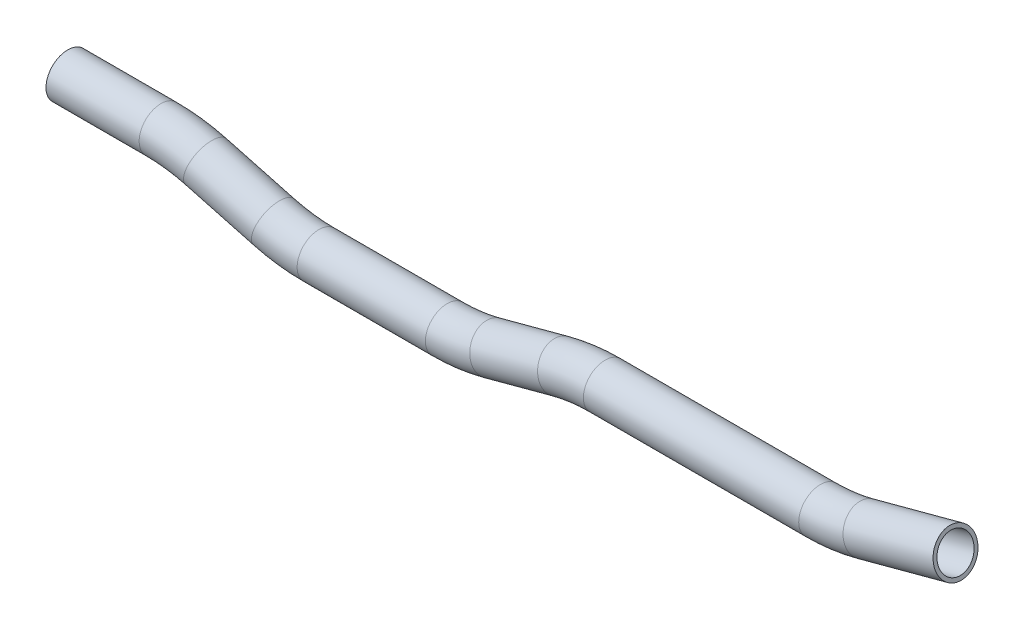
ISO-10303-21;
HEADER;
FILE_DESCRIPTION(('STEP AP214'),'2;1');
FILE_NAME('part.step','',(''),(''),'','','');
FILE_SCHEMA(('AUTOMOTIVE_DESIGN { 1 0 10303 214 1 1 1 1 }'));
ENDSEC;
DATA;
#1=APPLICATION_CONTEXT('core data for automotive mechanical design processes');
#2=APPLICATION_PROTOCOL_DEFINITION('international standard','automotive_design',2000,#1);
#3=PRODUCT_CONTEXT('',#1,'mechanical');
#4=PRODUCT('Part','Part','',(#3));
#5=PRODUCT_RELATED_PRODUCT_CATEGORY('part','',(#4));
#6=PRODUCT_DEFINITION_FORMATION('','',#4);
#7=PRODUCT_DEFINITION_CONTEXT('part definition',#1,'design');
#8=PRODUCT_DEFINITION('design','',#6,#7);
#9=PRODUCT_DEFINITION_SHAPE('','',#8);
#10=(LENGTH_UNIT() NAMED_UNIT(*) SI_UNIT(.MILLI.,.METRE.));
#11=(NAMED_UNIT(*) PLANE_ANGLE_UNIT() SI_UNIT($,.RADIAN.));
#12=(NAMED_UNIT(*) SI_UNIT($,.STERADIAN.) SOLID_ANGLE_UNIT());
#13=UNCERTAINTY_MEASURE_WITH_UNIT(LENGTH_MEASURE(1.E-05),#10,'distance_accuracy_value','');
#14=(GEOMETRIC_REPRESENTATION_CONTEXT(3) GLOBAL_UNCERTAINTY_ASSIGNED_CONTEXT((#13)) GLOBAL_UNIT_ASSIGNED_CONTEXT((#10,
#11,#12)) REPRESENTATION_CONTEXT('',''));
#15=CARTESIAN_POINT('',(0.,0.,0.));
#16=DIRECTION('',(0.,0.,1.));
#17=DIRECTION('',(1.,0.,0.));
#18=AXIS2_PLACEMENT_3D('',#15,#16,#17);
#19=CARTESIAN_POINT('',(27.5702699999885,26.4550342366762,0.));
#20=DIRECTION('',(1.,0.,0.));
#21=DIRECTION('',(0.,1.,0.));
#22=AXIS2_PLACEMENT_3D('',#19,#20,#21);
#23=CYLINDRICAL_SURFACE('',#22,9.525);
#24=CARTESIAN_POINT('',(68.338349683829,26.4550342366762,0.));
#25=DIRECTION('',(1.,0.,0.));
#26=DIRECTION('',(0.,1.,0.));
#27=AXIS2_PLACEMENT_3D('',#24,#25,#26);
#28=CIRCLE('',#27,9.525);
#29=CARTESIAN_POINT('',(68.338349683829,35.9800342366761,0.));
#30=VERTEX_POINT('',#29);
#31=EDGE_CURVE('E65',#30,#30,#28,.T.);
#32=ORIENTED_EDGE('',*,*,#31,.F.);
#33=EDGE_LOOP('',(#32));
#34=FACE_BOUND('',#33,.T.);
#35=CARTESIAN_POINT('',(27.5702699999885,26.4550342366762,0.));
#36=DIRECTION('',(1.,0.,0.));
#37=DIRECTION('',(0.,1.,0.));
#38=AXIS2_PLACEMENT_3D('',#35,#36,#37);
#39=CIRCLE('',#38,9.525);
#40=CARTESIAN_POINT('',(27.5702699999885,35.9800342366762,0.));
#41=VERTEX_POINT('',#40);
#42=EDGE_CURVE('E61',#41,#41,#39,.T.);
#43=ORIENTED_EDGE('',*,*,#42,.T.);
#44=EDGE_LOOP('',(#43));
#45=FACE_BOUND('',#44,.T.);
#46=ADVANCED_FACE('F37',(#34,#45),#23,.T.);
#47=CARTESIAN_POINT('',(68.338349683829,-49.7449657633238,0.));
#48=DIRECTION('',(0.,0.,-1.));
#49=DIRECTION('',(-1.,0.,0.));
#50=AXIS2_PLACEMENT_3D('',#47,#48,#49);
#51=TOROIDAL_SURFACE('',#50,76.2,9.525);
#52=CARTESIAN_POINT('',(88.0603609206411,23.8585821999032,0.));
#53=DIRECTION('',(0.965925826289068,-0.258819045102521,0.));
#54=DIRECTION('',(0.258819045102521,0.965925826289068,0.));
#55=AXIS2_PLACEMENT_3D('',#52,#53,#54);
#56=CIRCLE('',#55,9.525);
#57=CARTESIAN_POINT('',(90.5256123252426,33.0590256953065,0.));
#58=VERTEX_POINT('',#57);
#59=EDGE_CURVE('E69',#58,#58,#56,.T.);
#60=CARTESIAN_POINT('',(68.338349683829,-49.7449657633238,0.));
#61=DIRECTION('',(0.,0.,-1.));
#62=DIRECTION('',(-1.,0.,0.));
#63=AXIS2_PLACEMENT_3D('',#60,#61,#62);
#64=CIRCLE('',#63,85.725);
#65=EDGE_CURVE('',#30,#58,#64,.T.);
#66=ORIENTED_EDGE('',*,*,#31,.T.);
#67=ORIENTED_EDGE('',*,*,#59,.F.);
#68=ORIENTED_EDGE('',*,*,#65,.T.);
#69=ORIENTED_EDGE('',*,*,#65,.F.);
#70=EDGE_LOOP('',(#66,#68,#67,#69));
#71=FACE_BOUND('',#70,.T.);
#72=ADVANCED_FACE('F141',(#71),#51,.T.);
#73=CARTESIAN_POINT('',(88.0603609206411,23.8585821999032,0.));
#74=DIRECTION('',(0.965925826289068,-0.258819045102522,0.));
#75=DIRECTION('',(0.258819045102522,0.965925826289068,0.));
#76=AXIS2_PLACEMENT_3D('',#73,#74,#75);
#77=CYLINDRICAL_SURFACE('',#76,9.525);
#78=CARTESIAN_POINT('',(117.749211054821,15.9034787822411,0.));
#79=DIRECTION('',(0.965925826289068,-0.258819045102522,0.));
#80=DIRECTION('',(0.258819045102522,0.965925826289068,0.));
#81=AXIS2_PLACEMENT_3D('',#78,#79,#80);
#82=CIRCLE('',#81,9.525);
#83=CARTESIAN_POINT('',(115.283959650219,6.7030352868377,0.));
#84=VERTEX_POINT('',#83);
#85=EDGE_CURVE('E73',#84,#84,#82,.T.);
#86=ORIENTED_EDGE('',*,*,#85,.F.);
#87=EDGE_LOOP('',(#86));
#88=FACE_BOUND('',#87,.T.);
#89=ORIENTED_EDGE('',*,*,#59,.T.);
#90=EDGE_LOOP('',(#89));
#91=FACE_BOUND('',#90,.T.);
#92=ADVANCED_FACE('F145',(#88,#91),#77,.T.);
#93=CARTESIAN_POINT('',(137.471222291633,89.5070267454681,0.));
#94=DIRECTION('',(0.,0.,1.));
#95=DIRECTION('',(1.,0.,0.));
#96=AXIS2_PLACEMENT_3D('',#93,#94,#95);
#97=TOROIDAL_SURFACE('',#96,76.2,9.525);
#98=CARTESIAN_POINT('',(137.471222291633,13.3070267454681,0.));
#99=DIRECTION('',(1.,0.,0.));
#100=DIRECTION('',(0.,1.,0.));
#101=AXIS2_PLACEMENT_3D('',#98,#99,#100);
#102=CIRCLE('',#101,9.525);
#103=CARTESIAN_POINT('',(137.471222291633,3.78202674546807,0.));
#104=VERTEX_POINT('',#103);
#105=EDGE_CURVE('E77',#104,#104,#102,.T.);
#106=CARTESIAN_POINT('',(137.471222291633,89.5070267454681,0.));
#107=DIRECTION('',(0.,0.,1.));
#108=DIRECTION('',(1.,0.,0.));
#109=AXIS2_PLACEMENT_3D('',#106,#107,#108);
#110=CIRCLE('',#109,85.725);
#111=EDGE_CURVE('',#84,#104,#110,.T.);
#112=ORIENTED_EDGE('',*,*,#85,.T.);
#113=ORIENTED_EDGE('',*,*,#105,.F.);
#114=ORIENTED_EDGE('',*,*,#111,.T.);
#115=ORIENTED_EDGE('',*,*,#111,.F.);
#116=EDGE_LOOP('',(#112,#114,#113,#115));
#117=FACE_BOUND('',#116,.T.);
#118=ADVANCED_FACE('F149',(#117),#97,.T.);
#119=CARTESIAN_POINT('',(137.471222291633,13.3070267454681,0.));
#120=DIRECTION('',(1.,0.,0.));
#121=DIRECTION('',(0.,1.,0.));
#122=AXIS2_PLACEMENT_3D('',#119,#120,#121);
#123=CYLINDRICAL_SURFACE('',#122,9.525);
#124=CARTESIAN_POINT('',(193.607381659314,13.3070267454681,0.));
#125=DIRECTION('',(1.,0.,0.));
#126=DIRECTION('',(0.,1.,0.));
#127=AXIS2_PLACEMENT_3D('',#124,#125,#126);
#128=CIRCLE('',#127,9.525);
#129=CARTESIAN_POINT('',(193.607381659314,3.78202674546807,0.));
#130=VERTEX_POINT('',#129);
#131=EDGE_CURVE('E81',#130,#130,#128,.T.);
#132=ORIENTED_EDGE('',*,*,#131,.F.);
#133=EDGE_LOOP('',(#132));
#134=FACE_BOUND('',#133,.T.);
#135=ORIENTED_EDGE('',*,*,#105,.T.);
#136=EDGE_LOOP('',(#135));
#137=FACE_BOUND('',#136,.T.);
#138=ADVANCED_FACE('F153',(#134,#137),#123,.T.);
#139=CARTESIAN_POINT('',(193.607381659313,89.5070267454681,0.));
#140=DIRECTION('',(0.,0.,1.));
#141=DIRECTION('',(1.,0.,0.));
#142=AXIS2_PLACEMENT_3D('',#139,#140,#141);
#143=TOROIDAL_SURFACE('',#142,76.2,9.525);
#144=CARTESIAN_POINT('',(213.329392896126,15.9034787822411,0.));
#145=DIRECTION('',(0.965925826289068,0.258819045102522,0.));
#146=DIRECTION('',(-0.258819045102522,0.965925826289068,0.));
#147=AXIS2_PLACEMENT_3D('',#144,#145,#146);
#148=CIRCLE('',#147,9.525);
#149=CARTESIAN_POINT('',(215.794644300727,6.70303528683773,0.));
#150=VERTEX_POINT('',#149);
#151=EDGE_CURVE('E85',#150,#150,#148,.T.);
#152=CARTESIAN_POINT('',(193.607381659313,89.5070267454681,0.));
#153=DIRECTION('',(0.,0.,1.));
#154=DIRECTION('',(1.,0.,0.));
#155=AXIS2_PLACEMENT_3D('',#152,#153,#154);
#156=CIRCLE('',#155,85.7250000000001);
#157=EDGE_CURVE('',#130,#150,#156,.T.);
#158=ORIENTED_EDGE('',*,*,#131,.T.);
#159=ORIENTED_EDGE('',*,*,#151,.F.);
#160=ORIENTED_EDGE('',*,*,#157,.T.);
#161=ORIENTED_EDGE('',*,*,#157,.F.);
#162=EDGE_LOOP('',(#158,#160,#159,#161));
#163=FACE_BOUND('',#162,.T.);
#164=ADVANCED_FACE('F157',(#163),#143,.T.);
#165=CARTESIAN_POINT('',(213.329392896126,15.9034787822411,0.));
#166=DIRECTION('',(0.965925826289068,0.258819045102524,0.));
#167=DIRECTION('',(-0.258819045102524,0.965925826289068,0.));
#168=AXIS2_PLACEMENT_3D('',#165,#166,#167);
#169=CYLINDRICAL_SURFACE('',#168,9.525);
#170=CARTESIAN_POINT('',(243.018243030305,23.8585821999033,0.));
#171=DIRECTION('',(0.965925826289068,0.258819045102524,0.));
#172=DIRECTION('',(-0.258819045102524,0.965925826289068,0.));
#173=AXIS2_PLACEMENT_3D('',#170,#171,#172);
#174=CIRCLE('',#173,9.525);
#175=CARTESIAN_POINT('',(240.552991625704,33.0590256953066,0.));
#176=VERTEX_POINT('',#175);
#177=EDGE_CURVE('E89',#176,#176,#174,.T.);
#178=ORIENTED_EDGE('',*,*,#177,.F.);
#179=EDGE_LOOP('',(#178));
#180=FACE_BOUND('',#179,.T.);
#181=ORIENTED_EDGE('',*,*,#151,.T.);
#182=EDGE_LOOP('',(#181));
#183=FACE_BOUND('',#182,.T.);
#184=ADVANCED_FACE('F161',(#180,#183),#169,.T.);
#185=CARTESIAN_POINT('',(262.740254267118,-49.7449657633237,0.));
#186=DIRECTION('',(0.,0.,-1.));
#187=DIRECTION('',(-1.,0.,0.));
#188=AXIS2_PLACEMENT_3D('',#185,#186,#187);
#189=TOROIDAL_SURFACE('',#188,76.2,9.525);
#190=CARTESIAN_POINT('',(262.740254267118,26.4550342366763,0.));
#191=DIRECTION('',(1.,0.,0.));
#192=DIRECTION('',(0.,1.,0.));
#193=AXIS2_PLACEMENT_3D('',#190,#191,#192);
#194=CIRCLE('',#193,9.525);
#195=CARTESIAN_POINT('',(262.740254267118,35.9800342366763,0.));
#196=VERTEX_POINT('',#195);
#197=EDGE_CURVE('E93',#196,#196,#194,.T.);
#198=CARTESIAN_POINT('',(262.740254267118,-49.7449657633237,0.));
#199=DIRECTION('',(0.,0.,-1.));
#200=DIRECTION('',(-1.,0.,0.));
#201=AXIS2_PLACEMENT_3D('',#198,#199,#200);
#202=CIRCLE('',#201,85.725);
#203=EDGE_CURVE('',#176,#196,#202,.T.);
#204=ORIENTED_EDGE('',*,*,#177,.T.);
#205=ORIENTED_EDGE('',*,*,#197,.F.);
#206=ORIENTED_EDGE('',*,*,#203,.T.);
#207=ORIENTED_EDGE('',*,*,#203,.F.);
#208=EDGE_LOOP('',(#204,#206,#205,#207));
#209=FACE_BOUND('',#208,.T.);
#210=ADVANCED_FACE('F115',(#209),#189,.T.);
#211=CARTESIAN_POINT('',(262.740254267118,26.4550342366762,0.));
#212=DIRECTION('',(1.,0.,0.));
#213=DIRECTION('',(0.,1.,0.));
#214=AXIS2_PLACEMENT_3D('',#211,#212,#213);
#215=CYLINDRICAL_SURFACE('',#214,9.525);
#216=CARTESIAN_POINT('',(356.976413634798,26.4550342366764,0.));
#217=DIRECTION('',(1.,0.,0.));
#218=DIRECTION('',(0.,1.,0.));
#219=AXIS2_PLACEMENT_3D('',#216,#217,#218);
#220=CIRCLE('',#219,9.525);
#221=CARTESIAN_POINT('',(356.976413634798,16.9300342366764,0.));
#222=VERTEX_POINT('',#221);
#223=EDGE_CURVE('E96',#222,#222,#220,.T.);
#224=ORIENTED_EDGE('',*,*,#223,.F.);
#225=EDGE_LOOP('',(#224));
#226=FACE_BOUND('',#225,.T.);
#227=ORIENTED_EDGE('',*,*,#197,.T.);
#228=EDGE_LOOP('',(#227));
#229=FACE_BOUND('',#228,.T.);
#230=ADVANCED_FACE('F108',(#226,#229),#215,.T.);
#231=CARTESIAN_POINT('',(356.976413634798,102.655034236676,0.));
#232=DIRECTION('',(0.,0.,1.));
#233=DIRECTION('',(1.,0.,0.));
#234=AXIS2_PLACEMENT_3D('',#231,#232,#233);
#235=TOROIDAL_SURFACE('',#234,76.2,9.525);
#236=CARTESIAN_POINT('',(376.69842487161,29.0514862734495,0.));
#237=DIRECTION('',(0.965925826289068,0.258819045102522,0.));
#238=DIRECTION('',(-0.258819045102522,0.965925826289068,0.));
#239=AXIS2_PLACEMENT_3D('',#236,#237,#238);
#240=CIRCLE('',#239,9.525);
#241=CARTESIAN_POINT('',(379.163676276212,19.8510427780461,0.));
#242=VERTEX_POINT('',#241);
#243=EDGE_CURVE('E41',#242,#242,#240,.T.);
#244=CARTESIAN_POINT('',(356.976413634798,102.655034236676,0.));
#245=DIRECTION('',(0.,0.,1.));
#246=DIRECTION('',(1.,0.,0.));
#247=AXIS2_PLACEMENT_3D('',#244,#245,#246);
#248=CIRCLE('',#247,85.725);
#249=EDGE_CURVE('',#222,#242,#248,.T.);
#250=ORIENTED_EDGE('',*,*,#223,.T.);
#251=ORIENTED_EDGE('',*,*,#243,.F.);
#252=ORIENTED_EDGE('',*,*,#249,.T.);
#253=ORIENTED_EDGE('',*,*,#249,.F.);
#254=EDGE_LOOP('',(#250,#252,#251,#253));
#255=FACE_BOUND('',#254,.T.);
#256=ADVANCED_FACE('F106',(#255),#235,.T.);
#257=CARTESIAN_POINT('',(376.69842487161,29.0514862734495,0.));
#258=DIRECTION('',(0.965925826289068,0.258819045102522,0.));
#259=DIRECTION('',(-0.258819045102522,0.965925826289068,0.));
#260=AXIS2_PLACEMENT_3D('',#257,#258,#259);
#261=CYLINDRICAL_SURFACE('',#260,9.525);
#262=CARTESIAN_POINT('',(416.077365926443,39.6030417278846,0.));
#263=DIRECTION('',(0.965925826289068,0.258819045102522,0.));
#264=DIRECTION('',(-0.258819045102522,0.965925826289068,0.));
#265=AXIS2_PLACEMENT_3D('',#262,#263,#264);
#266=CIRCLE('',#265,9.525);
#267=CARTESIAN_POINT('',(413.612114521841,48.803485223288,0.));
#268=VERTEX_POINT('',#267);
#269=EDGE_CURVE('E56',#268,#268,#266,.T.);
#270=ORIENTED_EDGE('',*,*,#269,.F.);
#271=EDGE_LOOP('',(#270));
#272=FACE_BOUND('',#271,.T.);
#273=ORIENTED_EDGE('',*,*,#243,.T.);
#274=EDGE_LOOP('',(#273));
#275=FACE_BOUND('',#274,.T.);
#276=ADVANCED_FACE('F39',(#272,#275),#261,.T.);
#277=CARTESIAN_POINT('',(27.5702699999885,26.4550342366762,0.));
#278=DIRECTION('',(1.,0.,0.));
#279=DIRECTION('',(0.,1.,0.));
#280=AXIS2_PLACEMENT_3D('',#277,#278,#279);
#281=PLANE('',#280);
#282=CARTESIAN_POINT('',(27.5702699999885,26.4550342366762,0.));
#283=DIRECTION('',(1.,0.,0.));
#284=DIRECTION('',(0.,1.,0.));
#285=AXIS2_PLACEMENT_3D('',#282,#283,#284);
#286=CIRCLE('',#285,7.874);
#287=CARTESIAN_POINT('',(27.5702699999885,34.3290342366762,0.));
#288=VERTEX_POINT('',#287);
#289=EDGE_CURVE('E60',#288,#288,#286,.F.);
#290=ORIENTED_EDGE('',*,*,#289,.F.);
#291=EDGE_LOOP('',(#290));
#292=FACE_BOUND('',#291,.T.);
#293=ORIENTED_EDGE('',*,*,#42,.F.);
#294=EDGE_LOOP('',(#293));
#295=FACE_BOUND('',#294,.T.);
#296=ADVANCED_FACE('F113',(#292,#295),#281,.F.);
#297=CARTESIAN_POINT('',(416.077365926443,39.6030417278846,0.));
#298=DIRECTION('',(0.965925826289068,0.258819045102522,0.));
#299=DIRECTION('',(-0.258819045102522,0.965925826289068,0.));
#300=AXIS2_PLACEMENT_3D('',#297,#298,#299);
#301=PLANE('',#300);
#302=CARTESIAN_POINT('',(416.077365926443,39.6030417278846,0.));
#303=DIRECTION('',(0.965925826289068,0.258819045102522,0.));
#304=DIRECTION('',(-0.258819045102522,0.965925826289068,0.));
#305=AXIS2_PLACEMENT_3D('',#302,#303,#304);
#306=CIRCLE('',#305,7.874);
#307=CARTESIAN_POINT('',(414.039424765305,47.2087416840847,0.));
#308=VERTEX_POINT('',#307);
#309=EDGE_CURVE('E10',#308,#308,#306,.F.);
#310=ORIENTED_EDGE('',*,*,#309,.T.);
#311=EDGE_LOOP('',(#310));
#312=FACE_BOUND('',#311,.T.);
#313=ORIENTED_EDGE('',*,*,#269,.T.);
#314=EDGE_LOOP('',(#313));
#315=FACE_BOUND('',#314,.T.);
#316=ADVANCED_FACE('F132',(#312,#315),#301,.T.);
#317=CARTESIAN_POINT('',(27.5702699999885,26.4550342366762,0.));
#318=DIRECTION('',(1.,0.,0.));
#319=DIRECTION('',(0.,1.,0.));
#320=AXIS2_PLACEMENT_3D('',#317,#318,#319);
#321=CYLINDRICAL_SURFACE('',#320,7.874);
#322=CARTESIAN_POINT('',(68.338349683829,26.4550342366762,0.));
#323=DIRECTION('',(1.,0.,0.));
#324=DIRECTION('',(0.,1.,0.));
#325=AXIS2_PLACEMENT_3D('',#322,#323,#324);
#326=CIRCLE('',#325,7.874);
#327=CARTESIAN_POINT('',(68.338349683829,34.3290342366761,0.));
#328=VERTEX_POINT('',#327);
#329=EDGE_CURVE('E352',#328,#328,#326,.F.);
#330=ORIENTED_EDGE('',*,*,#329,.F.);
#331=EDGE_LOOP('',(#330));
#332=FACE_BOUND('',#331,.T.);
#333=ORIENTED_EDGE('',*,*,#289,.T.);
#334=EDGE_LOOP('',(#333));
#335=FACE_BOUND('',#334,.T.);
#336=ADVANCED_FACE('F135',(#332,#335),#321,.F.);
#337=CARTESIAN_POINT('',(68.338349683829,-49.7449657633238,0.));
#338=DIRECTION('',(0.,0.,-1.));
#339=DIRECTION('',(-1.,0.,0.));
#340=AXIS2_PLACEMENT_3D('',#337,#338,#339);
#341=TOROIDAL_SURFACE('',#340,76.2,7.874);
#342=CARTESIAN_POINT('',(88.0603609206411,23.8585821999032,0.));
#343=DIRECTION('',(0.965925826289068,-0.258819045102521,0.));
#344=DIRECTION('',(0.258819045102521,0.965925826289068,0.));
#345=AXIS2_PLACEMENT_3D('',#342,#343,#344);
#346=CIRCLE('',#345,7.874);
#347=CARTESIAN_POINT('',(90.0983020817783,31.4642821561033,0.));
#348=VERTEX_POINT('',#347);
#349=EDGE_CURVE('E348',#348,#348,#346,.F.);
#350=CARTESIAN_POINT('',(68.338349683829,-49.7449657633238,0.));
#351=DIRECTION('',(0.,0.,-1.));
#352=DIRECTION('',(-1.,0.,0.));
#353=AXIS2_PLACEMENT_3D('',#350,#351,#352);
#354=CIRCLE('',#353,84.074);
#355=EDGE_CURVE('',#328,#348,#354,.T.);
#356=ORIENTED_EDGE('',*,*,#329,.T.);
#357=ORIENTED_EDGE('',*,*,#349,.F.);
#358=ORIENTED_EDGE('',*,*,#355,.T.);
#359=ORIENTED_EDGE('',*,*,#355,.F.);
#360=EDGE_LOOP('',(#356,#358,#357,#359));
#361=FACE_BOUND('',#360,.T.);
#362=ADVANCED_FACE('F226',(#361),#341,.F.);
#363=CARTESIAN_POINT('',(88.0603609206411,23.8585821999032,0.));
#364=DIRECTION('',(0.965925826289068,-0.258819045102522,0.));
#365=DIRECTION('',(0.258819045102522,0.965925826289068,0.));
#366=AXIS2_PLACEMENT_3D('',#363,#364,#365);
#367=CYLINDRICAL_SURFACE('',#366,7.874);
#368=CARTESIAN_POINT('',(117.749211054821,15.9034787822411,0.));
#369=DIRECTION('',(0.965925826289068,-0.258819045102522,0.));
#370=DIRECTION('',(0.258819045102522,0.965925826289068,0.));
#371=AXIS2_PLACEMENT_3D('',#368,#369,#370);
#372=CIRCLE('',#371,7.874);
#373=CARTESIAN_POINT('',(115.711269893683,8.29777882604098,0.));
#374=VERTEX_POINT('',#373);
#375=EDGE_CURVE('E344',#374,#374,#372,.F.);
#376=ORIENTED_EDGE('',*,*,#375,.F.);
#377=EDGE_LOOP('',(#376));
#378=FACE_BOUND('',#377,.T.);
#379=ORIENTED_EDGE('',*,*,#349,.T.);
#380=EDGE_LOOP('',(#379));
#381=FACE_BOUND('',#380,.T.);
#382=ADVANCED_FACE('F236',(#378,#381),#367,.F.);
#383=CARTESIAN_POINT('',(137.471222291633,89.5070267454681,0.));
#384=DIRECTION('',(0.,0.,1.));
#385=DIRECTION('',(1.,0.,0.));
#386=AXIS2_PLACEMENT_3D('',#383,#384,#385);
#387=TOROIDAL_SURFACE('',#386,76.2,7.874);
#388=CARTESIAN_POINT('',(137.471222291633,13.3070267454681,0.));
#389=DIRECTION('',(1.,0.,0.));
#390=DIRECTION('',(0.,1.,0.));
#391=AXIS2_PLACEMENT_3D('',#388,#389,#390);
#392=CIRCLE('',#391,7.874);
#393=CARTESIAN_POINT('',(137.471222291633,5.43302674546808,0.));
#394=VERTEX_POINT('',#393);
#395=EDGE_CURVE('E340',#394,#394,#392,.F.);
#396=CARTESIAN_POINT('',(137.471222291633,89.5070267454681,0.));
#397=DIRECTION('',(0.,0.,1.));
#398=DIRECTION('',(1.,0.,0.));
#399=AXIS2_PLACEMENT_3D('',#396,#397,#398);
#400=CIRCLE('',#399,84.074);
#401=EDGE_CURVE('',#374,#394,#400,.T.);
#402=ORIENTED_EDGE('',*,*,#375,.T.);
#403=ORIENTED_EDGE('',*,*,#395,.F.);
#404=ORIENTED_EDGE('',*,*,#401,.T.);
#405=ORIENTED_EDGE('',*,*,#401,.F.);
#406=EDGE_LOOP('',(#402,#404,#403,#405));
#407=FACE_BOUND('',#406,.T.);
#408=ADVANCED_FACE('F246',(#407),#387,.F.);
#409=CARTESIAN_POINT('',(137.471222291633,13.3070267454681,0.));
#410=DIRECTION('',(1.,0.,0.));
#411=DIRECTION('',(0.,1.,0.));
#412=AXIS2_PLACEMENT_3D('',#409,#410,#411);
#413=CYLINDRICAL_SURFACE('',#412,7.874);
#414=CARTESIAN_POINT('',(193.607381659314,13.3070267454681,0.));
#415=DIRECTION('',(1.,0.,0.));
#416=DIRECTION('',(0.,1.,0.));
#417=AXIS2_PLACEMENT_3D('',#414,#415,#416);
#418=CIRCLE('',#417,7.874);
#419=CARTESIAN_POINT('',(193.607381659314,5.43302674546808,0.));
#420=VERTEX_POINT('',#419);
#421=EDGE_CURVE('E336',#420,#420,#418,.F.);
#422=ORIENTED_EDGE('',*,*,#421,.F.);
#423=EDGE_LOOP('',(#422));
#424=FACE_BOUND('',#423,.T.);
#425=ORIENTED_EDGE('',*,*,#395,.T.);
#426=EDGE_LOOP('',(#425));
#427=FACE_BOUND('',#426,.T.);
#428=ADVANCED_FACE('F256',(#424,#427),#413,.F.);
#429=CARTESIAN_POINT('',(193.607381659313,89.5070267454681,0.));
#430=DIRECTION('',(0.,0.,1.));
#431=DIRECTION('',(1.,0.,0.));
#432=AXIS2_PLACEMENT_3D('',#429,#430,#431);
#433=TOROIDAL_SURFACE('',#432,76.2,7.874);
#434=CARTESIAN_POINT('',(213.329392896126,15.9034787822411,0.));
#435=DIRECTION('',(0.965925826289068,0.258819045102522,0.));
#436=DIRECTION('',(-0.258819045102522,0.965925826289068,0.));
#437=AXIS2_PLACEMENT_3D('',#434,#435,#436);
#438=CIRCLE('',#437,7.874);
#439=CARTESIAN_POINT('',(215.367334057263,8.29777882604099,0.));
#440=VERTEX_POINT('',#439);
#441=EDGE_CURVE('E330',#440,#440,#438,.F.);
#442=CARTESIAN_POINT('',(193.607381659313,89.5070267454681,0.));
#443=DIRECTION('',(0.,0.,1.));
#444=DIRECTION('',(1.,0.,0.));
#445=AXIS2_PLACEMENT_3D('',#442,#443,#444);
#446=CIRCLE('',#445,84.074);
#447=EDGE_CURVE('',#420,#440,#446,.T.);
#448=ORIENTED_EDGE('',*,*,#421,.T.);
#449=ORIENTED_EDGE('',*,*,#441,.F.);
#450=ORIENTED_EDGE('',*,*,#447,.T.);
#451=ORIENTED_EDGE('',*,*,#447,.F.);
#452=EDGE_LOOP('',(#448,#450,#449,#451));
#453=FACE_BOUND('',#452,.T.);
#454=ADVANCED_FACE('F266',(#453),#433,.F.);
#455=CARTESIAN_POINT('',(213.329392896126,15.9034787822411,0.));
#456=DIRECTION('',(0.965925826289068,0.258819045102524,0.));
#457=DIRECTION('',(-0.258819045102524,0.965925826289068,0.));
#458=AXIS2_PLACEMENT_3D('',#455,#456,#457);
#459=CYLINDRICAL_SURFACE('',#458,7.874);
#460=CARTESIAN_POINT('',(243.018243030305,23.8585821999033,0.));
#461=DIRECTION('',(0.965925826289068,0.258819045102524,0.));
#462=DIRECTION('',(-0.258819045102524,0.965925826289068,0.));
#463=AXIS2_PLACEMENT_3D('',#460,#461,#462);
#464=CIRCLE('',#463,7.874);
#465=CARTESIAN_POINT('',(240.980301869168,31.4642821561034,0.));
#466=VERTEX_POINT('',#465);
#467=EDGE_CURVE('E325',#466,#466,#464,.F.);
#468=ORIENTED_EDGE('',*,*,#467,.F.);
#469=EDGE_LOOP('',(#468));
#470=FACE_BOUND('',#469,.T.);
#471=ORIENTED_EDGE('',*,*,#441,.T.);
#472=EDGE_LOOP('',(#471));
#473=FACE_BOUND('',#472,.T.);
#474=ADVANCED_FACE('F276',(#470,#473),#459,.F.);
#475=CARTESIAN_POINT('',(262.740254267118,-49.7449657633237,0.));
#476=DIRECTION('',(0.,0.,-1.));
#477=DIRECTION('',(-1.,0.,0.));
#478=AXIS2_PLACEMENT_3D('',#475,#476,#477);
#479=TOROIDAL_SURFACE('',#478,76.2,7.874);
#480=CARTESIAN_POINT('',(262.740254267118,26.4550342366763,0.));
#481=DIRECTION('',(1.,0.,0.));
#482=DIRECTION('',(0.,1.,0.));
#483=AXIS2_PLACEMENT_3D('',#480,#481,#482);
#484=CIRCLE('',#483,7.874);
#485=CARTESIAN_POINT('',(262.740254267118,34.3290342366763,0.));
#486=VERTEX_POINT('',#485);
#487=EDGE_CURVE('E323',#486,#486,#484,.F.);
#488=CARTESIAN_POINT('',(262.740254267118,-49.7449657633237,0.));
#489=DIRECTION('',(0.,0.,-1.));
#490=DIRECTION('',(-1.,0.,0.));
#491=AXIS2_PLACEMENT_3D('',#488,#489,#490);
#492=CIRCLE('',#491,84.074);
#493=EDGE_CURVE('',#466,#486,#492,.T.);
#494=ORIENTED_EDGE('',*,*,#467,.T.);
#495=ORIENTED_EDGE('',*,*,#487,.F.);
#496=ORIENTED_EDGE('',*,*,#493,.T.);
#497=ORIENTED_EDGE('',*,*,#493,.F.);
#498=EDGE_LOOP('',(#494,#496,#495,#497));
#499=FACE_BOUND('',#498,.T.);
#500=ADVANCED_FACE('F286',(#499),#479,.F.);
#501=CARTESIAN_POINT('',(262.740254267118,26.4550342366762,0.));
#502=DIRECTION('',(1.,0.,0.));
#503=DIRECTION('',(0.,1.,0.));
#504=AXIS2_PLACEMENT_3D('',#501,#502,#503);
#505=CYLINDRICAL_SURFACE('',#504,7.874);
#506=CARTESIAN_POINT('',(356.976413634798,26.4550342366764,0.));
#507=DIRECTION('',(1.,0.,0.));
#508=DIRECTION('',(0.,1.,0.));
#509=AXIS2_PLACEMENT_3D('',#506,#507,#508);
#510=CIRCLE('',#509,7.874);
#511=CARTESIAN_POINT('',(356.976413634798,18.5810342366764,0.));
#512=VERTEX_POINT('',#511);
#513=EDGE_CURVE('E52',#512,#512,#510,.F.);
#514=ORIENTED_EDGE('',*,*,#513,.F.);
#515=EDGE_LOOP('',(#514));
#516=FACE_BOUND('',#515,.T.);
#517=ORIENTED_EDGE('',*,*,#487,.T.);
#518=EDGE_LOOP('',(#517));
#519=FACE_BOUND('',#518,.T.);
#520=ADVANCED_FACE('F126',(#516,#519),#505,.F.);
#521=CARTESIAN_POINT('',(356.976413634798,102.655034236676,0.));
#522=DIRECTION('',(0.,0.,1.));
#523=DIRECTION('',(1.,0.,0.));
#524=AXIS2_PLACEMENT_3D('',#521,#522,#523);
#525=TOROIDAL_SURFACE('',#524,76.2,7.874);
#526=CARTESIAN_POINT('',(376.69842487161,29.0514862734495,0.));
#527=DIRECTION('',(0.965925826289068,0.258819045102522,0.));
#528=DIRECTION('',(-0.258819045102522,0.965925826289068,0.));
#529=AXIS2_PLACEMENT_3D('',#526,#527,#528);
#530=CIRCLE('',#529,7.874);
#531=CARTESIAN_POINT('',(378.736366032748,21.4457863172493,0.));
#532=VERTEX_POINT('',#531);
#533=EDGE_CURVE('E46',#532,#532,#530,.F.);
#534=CARTESIAN_POINT('',(356.976413634798,102.655034236676,0.));
#535=DIRECTION('',(0.,0.,1.));
#536=DIRECTION('',(1.,0.,0.));
#537=AXIS2_PLACEMENT_3D('',#534,#535,#536);
#538=CIRCLE('',#537,84.074);
#539=EDGE_CURVE('',#512,#532,#538,.T.);
#540=ORIENTED_EDGE('',*,*,#513,.T.);
#541=ORIENTED_EDGE('',*,*,#533,.F.);
#542=ORIENTED_EDGE('',*,*,#539,.T.);
#543=ORIENTED_EDGE('',*,*,#539,.F.);
#544=EDGE_LOOP('',(#540,#542,#541,#543));
#545=FACE_BOUND('',#544,.T.);
#546=ADVANCED_FACE('F120',(#545),#525,.F.);
#547=CARTESIAN_POINT('',(376.69842487161,29.0514862734495,0.));
#548=DIRECTION('',(0.965925826289068,0.258819045102522,0.));
#549=DIRECTION('',(-0.258819045102522,0.965925826289068,0.));
#550=AXIS2_PLACEMENT_3D('',#547,#548,#549);
#551=CYLINDRICAL_SURFACE('',#550,7.874);
#552=ORIENTED_EDGE('',*,*,#309,.F.);
#553=EDGE_LOOP('',(#552));
#554=FACE_BOUND('',#553,.T.);
#555=ORIENTED_EDGE('',*,*,#533,.T.);
#556=EDGE_LOOP('',(#555));
#557=FACE_BOUND('',#556,.T.);
#558=ADVANCED_FACE('F118',(#554,#557),#551,.F.);
#559=CLOSED_SHELL('',(#46,#72,#92,#118,#138,#164,#184,#210,#230,#256,#276,#296,#316,#336,#362,
#382,#408,#428,#454,#474,#500,#520,#546,#558));
#560=MANIFOLD_SOLID_BREP('B2',#559);
#561=ADVANCED_BREP_SHAPE_REPRESENTATION('',(#18,#560),#14);
#562=SHAPE_DEFINITION_REPRESENTATION(#9,#561);
ENDSEC;
END-ISO-10303-21;
